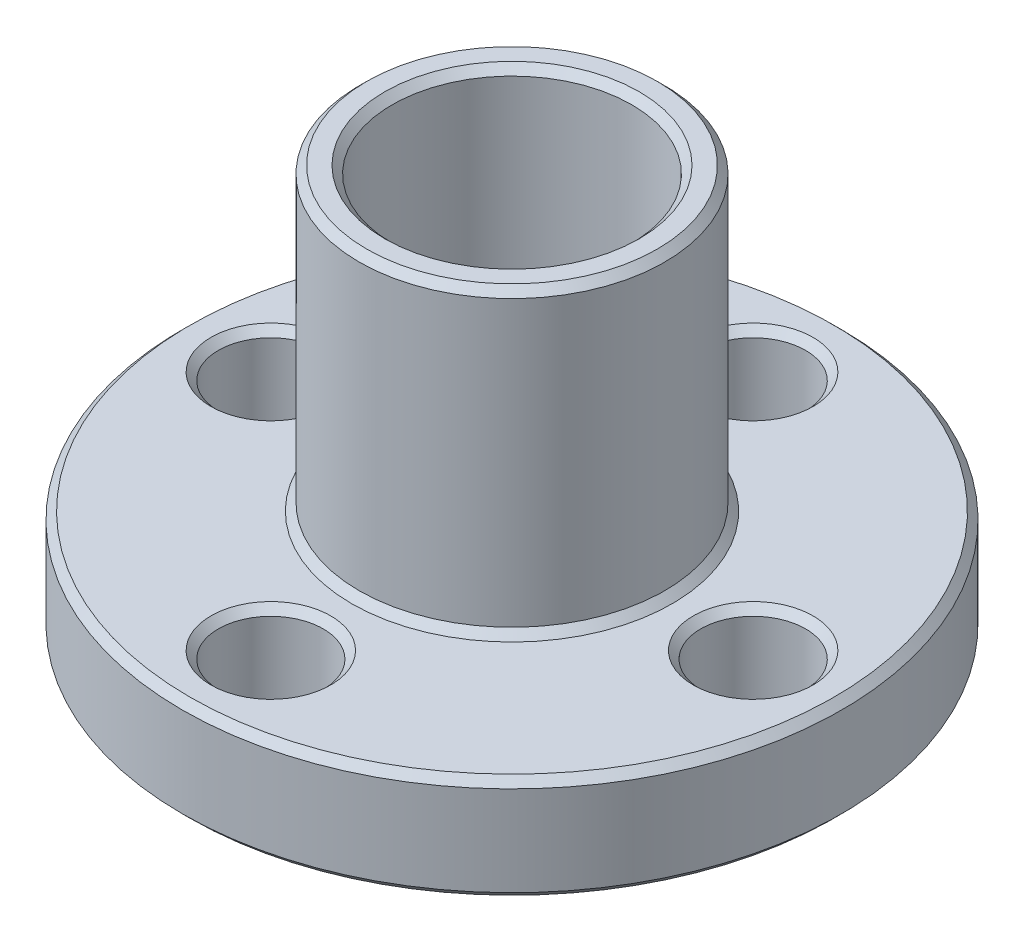
ISO-10303-21;
HEADER;
FILE_DESCRIPTION(('STEP AP214'),'2;1');
FILE_NAME('part.step','',(''),(''),'','','');
FILE_SCHEMA(('AUTOMOTIVE_DESIGN { 1 0 10303 214 1 1 1 1 }'));
ENDSEC;
DATA;
#1=APPLICATION_CONTEXT('core data for automotive mechanical design processes');
#2=APPLICATION_PROTOCOL_DEFINITION('international standard','automotive_design',2000,#1);
#3=PRODUCT_CONTEXT('',#1,'mechanical');
#4=PRODUCT('Part','Part','',(#3));
#5=PRODUCT_RELATED_PRODUCT_CATEGORY('part','',(#4));
#6=PRODUCT_DEFINITION_FORMATION('','',#4);
#7=PRODUCT_DEFINITION_CONTEXT('part definition',#1,'design');
#8=PRODUCT_DEFINITION('design','',#6,#7);
#9=PRODUCT_DEFINITION_SHAPE('','',#8);
#10=(LENGTH_UNIT() NAMED_UNIT(*) SI_UNIT(.MILLI.,.METRE.));
#11=(NAMED_UNIT(*) PLANE_ANGLE_UNIT() SI_UNIT($,.RADIAN.));
#12=(NAMED_UNIT(*) SI_UNIT($,.STERADIAN.) SOLID_ANGLE_UNIT());
#13=UNCERTAINTY_MEASURE_WITH_UNIT(LENGTH_MEASURE(1.E-05),#10,'distance_accuracy_value','');
#14=(GEOMETRIC_REPRESENTATION_CONTEXT(3) GLOBAL_UNCERTAINTY_ASSIGNED_CONTEXT((#13)) GLOBAL_UNIT_ASSIGNED_CONTEXT((#10,
#11,#12)) REPRESENTATION_CONTEXT('',''));
#15=CARTESIAN_POINT('',(0.,0.,0.));
#16=DIRECTION('',(0.,0.,1.));
#17=DIRECTION('',(1.,0.,0.));
#18=AXIS2_PLACEMENT_3D('',#15,#16,#17);
#19=CARTESIAN_POINT('',(0.,3.5,0.));
#20=DIRECTION('',(0.,-1.,0.));
#21=DIRECTION('',(0.,0.,-1.));
#22=AXIS2_PLACEMENT_3D('',#19,#20,#21);
#23=CYLINDRICAL_SURFACE('',#22,11.);
#24=CARTESIAN_POINT('',(0.,3.25,0.));
#25=DIRECTION('',(0.,1.,0.));
#26=DIRECTION('',(0.,0.,1.));
#27=AXIS2_PLACEMENT_3D('',#24,#25,#26);
#28=CIRCLE('',#27,11.);
#29=CARTESIAN_POINT('',(0.,3.25,11.));
#30=VERTEX_POINT('',#29);
#31=EDGE_CURVE('E10',#30,#30,#28,.F.);
#32=ORIENTED_EDGE('',*,*,#31,.T.);
#33=EDGE_LOOP('',(#32));
#34=FACE_BOUND('',#33,.T.);
#35=CARTESIAN_POINT('',(0.,0.249999999999999,0.));
#36=DIRECTION('',(0.,1.,0.));
#37=DIRECTION('',(0.,0.,1.));
#38=AXIS2_PLACEMENT_3D('',#35,#36,#37);
#39=CIRCLE('',#38,11.);
#40=CARTESIAN_POINT('',(0.,0.249999999999999,11.));
#41=VERTEX_POINT('',#40);
#42=EDGE_CURVE('E54',#41,#41,#39,.T.);
#43=ORIENTED_EDGE('',*,*,#42,.T.);
#44=EDGE_LOOP('',(#43));
#45=FACE_BOUND('',#44,.T.);
#46=ADVANCED_FACE('F45',(#34,#45),#23,.T.);
#47=CARTESIAN_POINT('',(0.,3.5,-8.04999999999955));
#48=DIRECTION('',(0.,-1.,0.));
#49=DIRECTION('',(0.,0.,-1.));
#50=AXIS2_PLACEMENT_3D('',#47,#48,#49);
#51=CYLINDRICAL_SURFACE('',#50,1.75);
#52=CARTESIAN_POINT('',(0.,3.25,-8.04999999999955));
#53=DIRECTION('',(0.,1.,0.));
#54=DIRECTION('',(0.,0.,1.));
#55=AXIS2_PLACEMENT_3D('',#52,#53,#54);
#56=CIRCLE('',#55,1.75);
#57=CARTESIAN_POINT('',(0.,3.25,-6.29999999999955));
#58=VERTEX_POINT('',#57);
#59=EDGE_CURVE('E102',#58,#58,#56,.T.);
#60=ORIENTED_EDGE('',*,*,#59,.T.);
#61=EDGE_LOOP('',(#60));
#62=FACE_BOUND('',#61,.T.);
#63=CARTESIAN_POINT('',(0.,0.250000000000001,-8.04999999999955));
#64=DIRECTION('',(0.,1.,0.));
#65=DIRECTION('',(0.,0.,1.));
#66=AXIS2_PLACEMENT_3D('',#63,#64,#65);
#67=CIRCLE('',#66,1.75);
#68=CARTESIAN_POINT('',(0.,0.250000000000001,-6.29999999999955));
#69=VERTEX_POINT('',#68);
#70=EDGE_CURVE('E106',#69,#69,#67,.F.);
#71=ORIENTED_EDGE('',*,*,#70,.T.);
#72=EDGE_LOOP('',(#71));
#73=FACE_BOUND('',#72,.T.);
#74=ADVANCED_FACE('F203',(#62,#73),#51,.F.);
#75=CARTESIAN_POINT('',(8.04999999999955,3.5,0.));
#76=DIRECTION('',(0.,-1.,0.));
#77=DIRECTION('',(0.,0.,-1.));
#78=AXIS2_PLACEMENT_3D('',#75,#76,#77);
#79=CYLINDRICAL_SURFACE('',#78,1.75);
#80=CARTESIAN_POINT('',(8.04999999999955,3.25,0.));
#81=DIRECTION('',(0.,1.,0.));
#82=DIRECTION('',(0.,0.,1.));
#83=AXIS2_PLACEMENT_3D('',#80,#81,#82);
#84=CIRCLE('',#83,1.75);
#85=CARTESIAN_POINT('',(8.04999999999955,3.25,1.75));
#86=VERTEX_POINT('',#85);
#87=EDGE_CURVE('E158',#86,#86,#84,.T.);
#88=ORIENTED_EDGE('',*,*,#87,.T.);
#89=EDGE_LOOP('',(#88));
#90=FACE_BOUND('',#89,.T.);
#91=CARTESIAN_POINT('',(8.04999999999955,0.250000000000002,0.));
#92=DIRECTION('',(0.,1.,0.));
#93=DIRECTION('',(0.,0.,1.));
#94=AXIS2_PLACEMENT_3D('',#91,#92,#93);
#95=CIRCLE('',#94,1.75);
#96=CARTESIAN_POINT('',(8.04999999999955,0.250000000000002,1.75));
#97=VERTEX_POINT('',#96);
#98=EDGE_CURVE('E162',#97,#97,#95,.F.);
#99=ORIENTED_EDGE('',*,*,#98,.T.);
#100=EDGE_LOOP('',(#99));
#101=FACE_BOUND('',#100,.T.);
#102=ADVANCED_FACE('F167',(#90,#101),#79,.F.);
#103=CARTESIAN_POINT('',(0.,3.5,8.04999999999955));
#104=DIRECTION('',(0.,-1.,0.));
#105=DIRECTION('',(0.,0.,-1.));
#106=AXIS2_PLACEMENT_3D('',#103,#104,#105);
#107=CYLINDRICAL_SURFACE('',#106,1.75);
#108=CARTESIAN_POINT('',(0.,0.250000000000003,8.04999999999955));
#109=DIRECTION('',(0.,1.,0.));
#110=DIRECTION('',(0.,0.,1.));
#111=AXIS2_PLACEMENT_3D('',#108,#109,#110);
#112=CIRCLE('',#111,1.75);
#113=CARTESIAN_POINT('',(0.,0.250000000000003,9.79999999999955));
#114=VERTEX_POINT('',#113);
#115=EDGE_CURVE('E94',#114,#114,#112,.F.);
#116=ORIENTED_EDGE('',*,*,#115,.T.);
#117=EDGE_LOOP('',(#116));
#118=FACE_BOUND('',#117,.T.);
#119=CARTESIAN_POINT('',(0.,3.25,8.04999999999955));
#120=DIRECTION('',(0.,1.,0.));
#121=DIRECTION('',(0.,0.,1.));
#122=AXIS2_PLACEMENT_3D('',#119,#120,#121);
#123=CIRCLE('',#122,1.75);
#124=CARTESIAN_POINT('',(0.,3.25,9.79999999999955));
#125=VERTEX_POINT('',#124);
#126=EDGE_CURVE('E98',#125,#125,#123,.T.);
#127=ORIENTED_EDGE('',*,*,#126,.T.);
#128=EDGE_LOOP('',(#127));
#129=FACE_BOUND('',#128,.T.);
#130=ADVANCED_FACE('F215',(#118,#129),#107,.F.);
#131=CARTESIAN_POINT('',(-8.04999999999955,3.5,0.));
#132=DIRECTION('',(0.,-1.,0.));
#133=DIRECTION('',(0.,0.,-1.));
#134=AXIS2_PLACEMENT_3D('',#131,#132,#133);
#135=CYLINDRICAL_SURFACE('',#134,1.75);
#136=CARTESIAN_POINT('',(-8.04999999999955,0.250000000000002,0.));
#137=DIRECTION('',(0.,1.,0.));
#138=DIRECTION('',(0.,0.,1.));
#139=AXIS2_PLACEMENT_3D('',#136,#137,#138);
#140=CIRCLE('',#139,1.75);
#141=CARTESIAN_POINT('',(-8.04999999999955,0.250000000000002,1.75));
#142=VERTEX_POINT('',#141);
#143=EDGE_CURVE('E86',#142,#142,#140,.F.);
#144=ORIENTED_EDGE('',*,*,#143,.T.);
#145=EDGE_LOOP('',(#144));
#146=FACE_BOUND('',#145,.T.);
#147=CARTESIAN_POINT('',(-8.04999999999955,3.25,0.));
#148=DIRECTION('',(0.,1.,0.));
#149=DIRECTION('',(0.,0.,1.));
#150=AXIS2_PLACEMENT_3D('',#147,#148,#149);
#151=CIRCLE('',#150,1.75);
#152=CARTESIAN_POINT('',(-8.04999999999955,3.25,1.75));
#153=VERTEX_POINT('',#152);
#154=EDGE_CURVE('E90',#153,#153,#151,.T.);
#155=ORIENTED_EDGE('',*,*,#154,.T.);
#156=EDGE_LOOP('',(#155));
#157=FACE_BOUND('',#156,.T.);
#158=ADVANCED_FACE('F219',(#146,#157),#135,.F.);
#159=CARTESIAN_POINT('',(0.,3.5,0.));
#160=DIRECTION('',(0.,-1.,0.));
#161=DIRECTION('',(0.,0.,-1.));
#162=AXIS2_PLACEMENT_3D('',#159,#160,#161);
#163=CYLINDRICAL_SURFACE('',#162,4.);
#164=CARTESIAN_POINT('',(0.,13.25,0.));
#165=DIRECTION('',(0.,1.,0.));
#166=DIRECTION('',(0.,0.,1.));
#167=AXIS2_PLACEMENT_3D('',#164,#165,#166);
#168=CIRCLE('',#167,4.);
#169=CARTESIAN_POINT('',(0.,13.25,4.));
#170=VERTEX_POINT('',#169);
#171=EDGE_CURVE('E78',#170,#170,#168,.T.);
#172=ORIENTED_EDGE('',*,*,#171,.T.);
#173=EDGE_LOOP('',(#172));
#174=FACE_BOUND('',#173,.T.);
#175=CARTESIAN_POINT('',(0.,0.25,0.));
#176=DIRECTION('',(0.,1.,0.));
#177=DIRECTION('',(0.,0.,1.));
#178=AXIS2_PLACEMENT_3D('',#175,#176,#177);
#179=CIRCLE('',#178,4.);
#180=CARTESIAN_POINT('',(0.,0.25,4.));
#181=VERTEX_POINT('',#180);
#182=EDGE_CURVE('E82',#181,#181,#179,.F.);
#183=ORIENTED_EDGE('',*,*,#182,.T.);
#184=EDGE_LOOP('',(#183));
#185=FACE_BOUND('',#184,.T.);
#186=ADVANCED_FACE('F211',(#174,#185),#163,.F.);
#187=CARTESIAN_POINT('',(0.,3.5,0.));
#188=DIRECTION('',(0.,1.,0.));
#189=DIRECTION('',(0.,0.,1.));
#190=AXIS2_PLACEMENT_3D('',#187,#188,#189);
#191=PLANE('',#190);
#192=CARTESIAN_POINT('',(8.04999999999955,3.5,0.));
#193=DIRECTION('',(0.,1.,0.));
#194=DIRECTION('',(0.,0.,1.));
#195=AXIS2_PLACEMENT_3D('',#192,#193,#194);
#196=CIRCLE('',#195,2.);
#197=CARTESIAN_POINT('',(8.04999999999955,3.5,2.));
#198=VERTEX_POINT('',#197);
#199=EDGE_CURVE('E134',#198,#198,#196,.F.);
#200=ORIENTED_EDGE('',*,*,#199,.T.);
#201=EDGE_LOOP('',(#200));
#202=FACE_BOUND('',#201,.T.);
#203=CARTESIAN_POINT('',(0.,3.5,-8.04999999999955));
#204=DIRECTION('',(0.,1.,0.));
#205=DIRECTION('',(0.,0.,1.));
#206=AXIS2_PLACEMENT_3D('',#203,#204,#205);
#207=CIRCLE('',#206,2.);
#208=CARTESIAN_POINT('',(0.,3.5,-6.04999999999955));
#209=VERTEX_POINT('',#208);
#210=EDGE_CURVE('E138',#209,#209,#207,.F.);
#211=ORIENTED_EDGE('',*,*,#210,.T.);
#212=EDGE_LOOP('',(#211));
#213=FACE_BOUND('',#212,.T.);
#214=CARTESIAN_POINT('',(0.,3.5,8.04999999999955));
#215=DIRECTION('',(0.,1.,0.));
#216=DIRECTION('',(0.,0.,1.));
#217=AXIS2_PLACEMENT_3D('',#214,#215,#216);
#218=CIRCLE('',#217,2.);
#219=CARTESIAN_POINT('',(0.,3.5,10.0499999999996));
#220=VERTEX_POINT('',#219);
#221=EDGE_CURVE('E142',#220,#220,#218,.F.);
#222=ORIENTED_EDGE('',*,*,#221,.T.);
#223=EDGE_LOOP('',(#222));
#224=FACE_BOUND('',#223,.T.);
#225=CARTESIAN_POINT('',(-8.04999999999955,3.5,0.));
#226=DIRECTION('',(0.,1.,0.));
#227=DIRECTION('',(0.,0.,1.));
#228=AXIS2_PLACEMENT_3D('',#225,#226,#227);
#229=CIRCLE('',#228,2.);
#230=CARTESIAN_POINT('',(-8.04999999999955,3.5,2.));
#231=VERTEX_POINT('',#230);
#232=EDGE_CURVE('E146',#231,#231,#229,.F.);
#233=ORIENTED_EDGE('',*,*,#232,.T.);
#234=EDGE_LOOP('',(#233));
#235=FACE_BOUND('',#234,.T.);
#236=CARTESIAN_POINT('',(0.,3.5,0.));
#237=DIRECTION('',(0.,1.,0.));
#238=DIRECTION('',(0.,0.,1.));
#239=AXIS2_PLACEMENT_3D('',#236,#237,#238);
#240=CIRCLE('',#239,5.35);
#241=CARTESIAN_POINT('',(0.,3.5,5.35));
#242=VERTEX_POINT('',#241);
#243=EDGE_CURVE('E150',#242,#242,#240,.F.);
#244=ORIENTED_EDGE('',*,*,#243,.T.);
#245=EDGE_LOOP('',(#244));
#246=FACE_BOUND('',#245,.T.);
#247=CARTESIAN_POINT('',(0.,3.5,0.));
#248=DIRECTION('',(0.,1.,0.));
#249=DIRECTION('',(0.,0.,1.));
#250=AXIS2_PLACEMENT_3D('',#247,#248,#249);
#251=CIRCLE('',#250,10.75);
#252=CARTESIAN_POINT('',(0.,3.5,10.75));
#253=VERTEX_POINT('',#252);
#254=EDGE_CURVE('E154',#253,#253,#251,.T.);
#255=ORIENTED_EDGE('',*,*,#254,.T.);
#256=EDGE_LOOP('',(#255));
#257=FACE_BOUND('',#256,.T.);
#258=ADVANCED_FACE('F181',(#202,#213,#224,#235,#246,#257),#191,.T.);
#259=CARTESIAN_POINT('',(0.,0.,0.));
#260=DIRECTION('',(0.,1.,0.));
#261=DIRECTION('',(0.,0.,1.));
#262=AXIS2_PLACEMENT_3D('',#259,#260,#261);
#263=PLANE('',#262);
#264=CARTESIAN_POINT('',(8.04999999999955,0.,0.));
#265=DIRECTION('',(0.,1.,0.));
#266=DIRECTION('',(0.,0.,1.));
#267=AXIS2_PLACEMENT_3D('',#264,#265,#266);
#268=CIRCLE('',#267,2.);
#269=CARTESIAN_POINT('',(8.04999999999955,0.,2.));
#270=VERTEX_POINT('',#269);
#271=EDGE_CURVE('E110',#270,#270,#268,.T.);
#272=ORIENTED_EDGE('',*,*,#271,.T.);
#273=EDGE_LOOP('',(#272));
#274=FACE_BOUND('',#273,.T.);
#275=CARTESIAN_POINT('',(0.,0.,-8.04999999999955));
#276=DIRECTION('',(0.,1.,0.));
#277=DIRECTION('',(0.,0.,1.));
#278=AXIS2_PLACEMENT_3D('',#275,#276,#277);
#279=CIRCLE('',#278,1.99999999999999);
#280=CARTESIAN_POINT('',(0.,0.,-6.04999999999956));
#281=VERTEX_POINT('',#280);
#282=EDGE_CURVE('E114',#281,#281,#279,.T.);
#283=ORIENTED_EDGE('',*,*,#282,.T.);
#284=EDGE_LOOP('',(#283));
#285=FACE_BOUND('',#284,.T.);
#286=CARTESIAN_POINT('',(0.,0.,8.04999999999955));
#287=DIRECTION('',(0.,1.,0.));
#288=DIRECTION('',(0.,0.,1.));
#289=AXIS2_PLACEMENT_3D('',#286,#287,#288);
#290=CIRCLE('',#289,2.);
#291=CARTESIAN_POINT('',(0.,0.,10.0499999999995));
#292=VERTEX_POINT('',#291);
#293=EDGE_CURVE('E118',#292,#292,#290,.T.);
#294=ORIENTED_EDGE('',*,*,#293,.T.);
#295=EDGE_LOOP('',(#294));
#296=FACE_BOUND('',#295,.T.);
#297=CARTESIAN_POINT('',(-8.04999999999955,0.,0.));
#298=DIRECTION('',(0.,1.,0.));
#299=DIRECTION('',(0.,0.,1.));
#300=AXIS2_PLACEMENT_3D('',#297,#298,#299);
#301=CIRCLE('',#300,2.);
#302=CARTESIAN_POINT('',(-8.04999999999955,0.,2.));
#303=VERTEX_POINT('',#302);
#304=EDGE_CURVE('E122',#303,#303,#301,.T.);
#305=ORIENTED_EDGE('',*,*,#304,.T.);
#306=EDGE_LOOP('',(#305));
#307=FACE_BOUND('',#306,.T.);
#308=CARTESIAN_POINT('',(0.,0.,0.));
#309=DIRECTION('',(0.,1.,0.));
#310=DIRECTION('',(0.,0.,1.));
#311=AXIS2_PLACEMENT_3D('',#308,#309,#310);
#312=CIRCLE('',#311,10.75);
#313=CARTESIAN_POINT('',(0.,0.,10.75));
#314=VERTEX_POINT('',#313);
#315=EDGE_CURVE('E126',#314,#314,#312,.F.);
#316=ORIENTED_EDGE('',*,*,#315,.T.);
#317=EDGE_LOOP('',(#316));
#318=FACE_BOUND('',#317,.T.);
#319=CARTESIAN_POINT('',(0.,0.,0.));
#320=DIRECTION('',(0.,1.,0.));
#321=DIRECTION('',(0.,0.,1.));
#322=AXIS2_PLACEMENT_3D('',#319,#320,#321);
#323=CIRCLE('',#322,4.25);
#324=CARTESIAN_POINT('',(0.,0.,4.25));
#325=VERTEX_POINT('',#324);
#326=EDGE_CURVE('E130',#325,#325,#323,.T.);
#327=ORIENTED_EDGE('',*,*,#326,.T.);
#328=EDGE_LOOP('',(#327));
#329=FACE_BOUND('',#328,.T.);
#330=ADVANCED_FACE('F177',(#274,#285,#296,#307,#318,#329),#263,.F.);
#331=CARTESIAN_POINT('',(0.,13.5,0.));
#332=DIRECTION('',(0.,-1.,0.));
#333=DIRECTION('',(0.,0.,-1.));
#334=AXIS2_PLACEMENT_3D('',#331,#332,#333);
#335=CYLINDRICAL_SURFACE('',#334,5.1);
#336=CARTESIAN_POINT('',(0.,13.25,0.));
#337=DIRECTION('',(0.,1.,0.));
#338=DIRECTION('',(0.,0.,1.));
#339=AXIS2_PLACEMENT_3D('',#336,#337,#338);
#340=CIRCLE('',#339,5.1);
#341=CARTESIAN_POINT('',(0.,13.25,5.1));
#342=VERTEX_POINT('',#341);
#343=EDGE_CURVE('E59',#342,#342,#340,.F.);
#344=ORIENTED_EDGE('',*,*,#343,.T.);
#345=EDGE_LOOP('',(#344));
#346=FACE_BOUND('',#345,.T.);
#347=CARTESIAN_POINT('',(0.,3.75,0.));
#348=DIRECTION('',(0.,1.,0.));
#349=DIRECTION('',(0.,0.,1.));
#350=AXIS2_PLACEMENT_3D('',#347,#348,#349);
#351=CIRCLE('',#350,5.1);
#352=CARTESIAN_POINT('',(0.,3.75,5.1));
#353=VERTEX_POINT('',#352);
#354=EDGE_CURVE('E64',#353,#353,#351,.T.);
#355=ORIENTED_EDGE('',*,*,#354,.T.);
#356=EDGE_LOOP('',(#355));
#357=FACE_BOUND('',#356,.T.);
#358=ADVANCED_FACE('F180',(#346,#357),#335,.T.);
#359=CARTESIAN_POINT('',(0.,13.5,0.));
#360=DIRECTION('',(0.,1.,0.));
#361=DIRECTION('',(0.,0.,1.));
#362=AXIS2_PLACEMENT_3D('',#359,#360,#361);
#363=PLANE('',#362);
#364=CARTESIAN_POINT('',(0.,13.5,0.));
#365=DIRECTION('',(0.,1.,0.));
#366=DIRECTION('',(0.,0.,1.));
#367=AXIS2_PLACEMENT_3D('',#364,#365,#366);
#368=CIRCLE('',#367,4.25);
#369=CARTESIAN_POINT('',(0.,13.5,4.25));
#370=VERTEX_POINT('',#369);
#371=EDGE_CURVE('E70',#370,#370,#368,.F.);
#372=ORIENTED_EDGE('',*,*,#371,.T.);
#373=EDGE_LOOP('',(#372));
#374=FACE_BOUND('',#373,.T.);
#375=CARTESIAN_POINT('',(0.,13.5,0.));
#376=DIRECTION('',(0.,1.,0.));
#377=DIRECTION('',(0.,0.,1.));
#378=AXIS2_PLACEMENT_3D('',#375,#376,#377);
#379=CIRCLE('',#378,4.85);
#380=CARTESIAN_POINT('',(0.,13.5,4.85));
#381=VERTEX_POINT('',#380);
#382=EDGE_CURVE('E74',#381,#381,#379,.T.);
#383=ORIENTED_EDGE('',*,*,#382,.T.);
#384=EDGE_LOOP('',(#383));
#385=FACE_BOUND('',#384,.T.);
#386=ADVANCED_FACE('F229',(#374,#385),#363,.T.);
#387=CARTESIAN_POINT('',(8.04999999999955,3.25,0.));
#388=DIRECTION('',(0.,1.,0.));
#389=DIRECTION('',(0.,0.,1.));
#390=AXIS2_PLACEMENT_3D('',#387,#388,#389);
#391=CONICAL_SURFACE('',#390,1.75,0.78539816339745);
#392=ORIENTED_EDGE('',*,*,#199,.F.);
#393=EDGE_LOOP('',(#392));
#394=FACE_BOUND('',#393,.T.);
#395=ORIENTED_EDGE('',*,*,#87,.F.);
#396=EDGE_LOOP('',(#395));
#397=FACE_BOUND('',#396,.T.);
#398=ADVANCED_FACE('F173',(#394,#397),#391,.F.);
#399=CARTESIAN_POINT('',(8.04999999999955,0.,0.));
#400=DIRECTION('',(0.,-1.,0.));
#401=DIRECTION('',(0.,0.,-1.));
#402=AXIS2_PLACEMENT_3D('',#399,#400,#401);
#403=CONICAL_SURFACE('',#402,2.,0.78539816339744);
#404=ORIENTED_EDGE('',*,*,#98,.F.);
#405=EDGE_LOOP('',(#404));
#406=FACE_BOUND('',#405,.T.);
#407=ORIENTED_EDGE('',*,*,#271,.F.);
#408=EDGE_LOOP('',(#407));
#409=FACE_BOUND('',#408,.T.);
#410=ADVANCED_FACE('F169',(#406,#409),#403,.F.);
#411=CARTESIAN_POINT('',(0.,3.25,-8.04999999999955));
#412=DIRECTION('',(0.,1.,0.));
#413=DIRECTION('',(0.,0.,1.));
#414=AXIS2_PLACEMENT_3D('',#411,#412,#413);
#415=CONICAL_SURFACE('',#414,1.75,0.785398163397449);
#416=ORIENTED_EDGE('',*,*,#210,.F.);
#417=EDGE_LOOP('',(#416));
#418=FACE_BOUND('',#417,.T.);
#419=ORIENTED_EDGE('',*,*,#59,.F.);
#420=EDGE_LOOP('',(#419));
#421=FACE_BOUND('',#420,.T.);
#422=ADVANCED_FACE('F172',(#418,#421),#415,.F.);
#423=CARTESIAN_POINT('',(0.,0.,-8.04999999999955));
#424=DIRECTION('',(0.,-1.,0.));
#425=DIRECTION('',(0.,0.,-1.));
#426=AXIS2_PLACEMENT_3D('',#423,#424,#425);
#427=CONICAL_SURFACE('',#426,1.99999999999999,0.785398163397437);
#428=ORIENTED_EDGE('',*,*,#70,.F.);
#429=EDGE_LOOP('',(#428));
#430=FACE_BOUND('',#429,.T.);
#431=ORIENTED_EDGE('',*,*,#282,.F.);
#432=EDGE_LOOP('',(#431));
#433=FACE_BOUND('',#432,.T.);
#434=ADVANCED_FACE('F240',(#430,#433),#427,.F.);
#435=CARTESIAN_POINT('',(0.,0.,8.04999999999955));
#436=DIRECTION('',(0.,-1.,0.));
#437=DIRECTION('',(0.,0.,-1.));
#438=AXIS2_PLACEMENT_3D('',#435,#436,#437);
#439=CONICAL_SURFACE('',#438,2.,0.785398163397439);
#440=ORIENTED_EDGE('',*,*,#115,.F.);
#441=EDGE_LOOP('',(#440));
#442=FACE_BOUND('',#441,.T.);
#443=ORIENTED_EDGE('',*,*,#293,.F.);
#444=EDGE_LOOP('',(#443));
#445=FACE_BOUND('',#444,.T.);
#446=ADVANCED_FACE('F247',(#442,#445),#439,.F.);
#447=CARTESIAN_POINT('',(0.,3.25,8.04999999999955));
#448=DIRECTION('',(0.,1.,0.));
#449=DIRECTION('',(0.,0.,1.));
#450=AXIS2_PLACEMENT_3D('',#447,#448,#449);
#451=CONICAL_SURFACE('',#450,1.75,0.78539816339745);
#452=ORIENTED_EDGE('',*,*,#221,.F.);
#453=EDGE_LOOP('',(#452));
#454=FACE_BOUND('',#453,.T.);
#455=ORIENTED_EDGE('',*,*,#126,.F.);
#456=EDGE_LOOP('',(#455));
#457=FACE_BOUND('',#456,.T.);
#458=ADVANCED_FACE('F254',(#454,#457),#451,.F.);
#459=CARTESIAN_POINT('',(-8.04999999999955,0.,0.));
#460=DIRECTION('',(0.,-1.,0.));
#461=DIRECTION('',(0.,0.,-1.));
#462=AXIS2_PLACEMENT_3D('',#459,#460,#461);
#463=CONICAL_SURFACE('',#462,2.,0.78539816339744);
#464=ORIENTED_EDGE('',*,*,#143,.F.);
#465=EDGE_LOOP('',(#464));
#466=FACE_BOUND('',#465,.T.);
#467=ORIENTED_EDGE('',*,*,#304,.F.);
#468=EDGE_LOOP('',(#467));
#469=FACE_BOUND('',#468,.T.);
#470=ADVANCED_FACE('F261',(#466,#469),#463,.F.);
#471=CARTESIAN_POINT('',(-8.04999999999955,3.25,0.));
#472=DIRECTION('',(0.,1.,0.));
#473=DIRECTION('',(0.,0.,1.));
#474=AXIS2_PLACEMENT_3D('',#471,#472,#473);
#475=CONICAL_SURFACE('',#474,1.75,0.78539816339745);
#476=ORIENTED_EDGE('',*,*,#232,.F.);
#477=EDGE_LOOP('',(#476));
#478=FACE_BOUND('',#477,.T.);
#479=ORIENTED_EDGE('',*,*,#154,.F.);
#480=EDGE_LOOP('',(#479));
#481=FACE_BOUND('',#480,.T.);
#482=ADVANCED_FACE('F268',(#478,#481),#475,.F.);
#483=CARTESIAN_POINT('',(0.,13.25,0.));
#484=DIRECTION('',(0.,1.,0.));
#485=DIRECTION('',(0.,0.,1.));
#486=AXIS2_PLACEMENT_3D('',#483,#484,#485);
#487=CONICAL_SURFACE('',#486,4.,0.785398163397455);
#488=ORIENTED_EDGE('',*,*,#371,.F.);
#489=EDGE_LOOP('',(#488));
#490=FACE_BOUND('',#489,.T.);
#491=ORIENTED_EDGE('',*,*,#171,.F.);
#492=EDGE_LOOP('',(#491));
#493=FACE_BOUND('',#492,.T.);
#494=ADVANCED_FACE('F275',(#490,#493),#487,.F.);
#495=CARTESIAN_POINT('',(0.,13.5,0.));
#496=DIRECTION('',(0.,-1.,0.));
#497=DIRECTION('',(0.,0.,-1.));
#498=AXIS2_PLACEMENT_3D('',#495,#496,#497);
#499=CONICAL_SURFACE('',#498,4.85,0.785398163397443);
#500=ORIENTED_EDGE('',*,*,#343,.F.);
#501=EDGE_LOOP('',(#500));
#502=FACE_BOUND('',#501,.T.);
#503=ORIENTED_EDGE('',*,*,#382,.F.);
#504=EDGE_LOOP('',(#503));
#505=FACE_BOUND('',#504,.T.);
#506=ADVANCED_FACE('F282',(#502,#505),#499,.T.);
#507=CARTESIAN_POINT('',(0.,3.5,0.));
#508=DIRECTION('',(0.,-1.,0.));
#509=DIRECTION('',(0.,0.,-1.));
#510=AXIS2_PLACEMENT_3D('',#507,#508,#509);
#511=CONICAL_SURFACE('',#510,5.35,0.785398163397447);
#512=ORIENTED_EDGE('',*,*,#354,.F.);
#513=EDGE_LOOP('',(#512));
#514=FACE_BOUND('',#513,.T.);
#515=ORIENTED_EDGE('',*,*,#243,.F.);
#516=EDGE_LOOP('',(#515));
#517=FACE_BOUND('',#516,.T.);
#518=ADVANCED_FACE('F289',(#514,#517),#511,.T.);
#519=CARTESIAN_POINT('',(0.,3.5,0.));
#520=DIRECTION('',(0.,-1.,0.));
#521=DIRECTION('',(0.,0.,-1.));
#522=AXIS2_PLACEMENT_3D('',#519,#520,#521);
#523=CONICAL_SURFACE('',#522,10.75,0.785398163397448);
#524=ORIENTED_EDGE('',*,*,#31,.F.);
#525=EDGE_LOOP('',(#524));
#526=FACE_BOUND('',#525,.T.);
#527=ORIENTED_EDGE('',*,*,#254,.F.);
#528=EDGE_LOOP('',(#527));
#529=FACE_BOUND('',#528,.T.);
#530=ADVANCED_FACE('F199',(#526,#529),#523,.T.);
#531=CARTESIAN_POINT('',(0.,0.249999999999999,0.));
#532=DIRECTION('',(0.,1.,0.));
#533=DIRECTION('',(0.,0.,1.));
#534=AXIS2_PLACEMENT_3D('',#531,#532,#533);
#535=CONICAL_SURFACE('',#534,11.,0.785398163397452);
#536=ORIENTED_EDGE('',*,*,#315,.F.);
#537=EDGE_LOOP('',(#536));
#538=FACE_BOUND('',#537,.T.);
#539=ORIENTED_EDGE('',*,*,#42,.F.);
#540=EDGE_LOOP('',(#539));
#541=FACE_BOUND('',#540,.T.);
#542=ADVANCED_FACE('F194',(#538,#541),#535,.T.);
#543=CARTESIAN_POINT('',(0.,0.,0.));
#544=DIRECTION('',(0.,-1.,0.));
#545=DIRECTION('',(0.,0.,-1.));
#546=AXIS2_PLACEMENT_3D('',#543,#544,#545);
#547=CONICAL_SURFACE('',#546,4.25,0.785398163397441);
#548=ORIENTED_EDGE('',*,*,#182,.F.);
#549=EDGE_LOOP('',(#548));
#550=FACE_BOUND('',#549,.T.);
#551=ORIENTED_EDGE('',*,*,#326,.F.);
#552=EDGE_LOOP('',(#551));
#553=FACE_BOUND('',#552,.T.);
#554=ADVANCED_FACE('F48',(#550,#553),#547,.F.);
#555=CLOSED_SHELL('',(#46,#74,#102,#130,#158,#186,#258,#330,#358,#386,#398,#410,#422,#434,#446,
#458,#470,#482,#494,#506,#518,#530,#542,#554));
#556=MANIFOLD_SOLID_BREP('B2',#555);
#557=ADVANCED_BREP_SHAPE_REPRESENTATION('',(#18,#556),#14);
#558=SHAPE_DEFINITION_REPRESENTATION(#9,#557);
ENDSEC;
END-ISO-10303-21;
